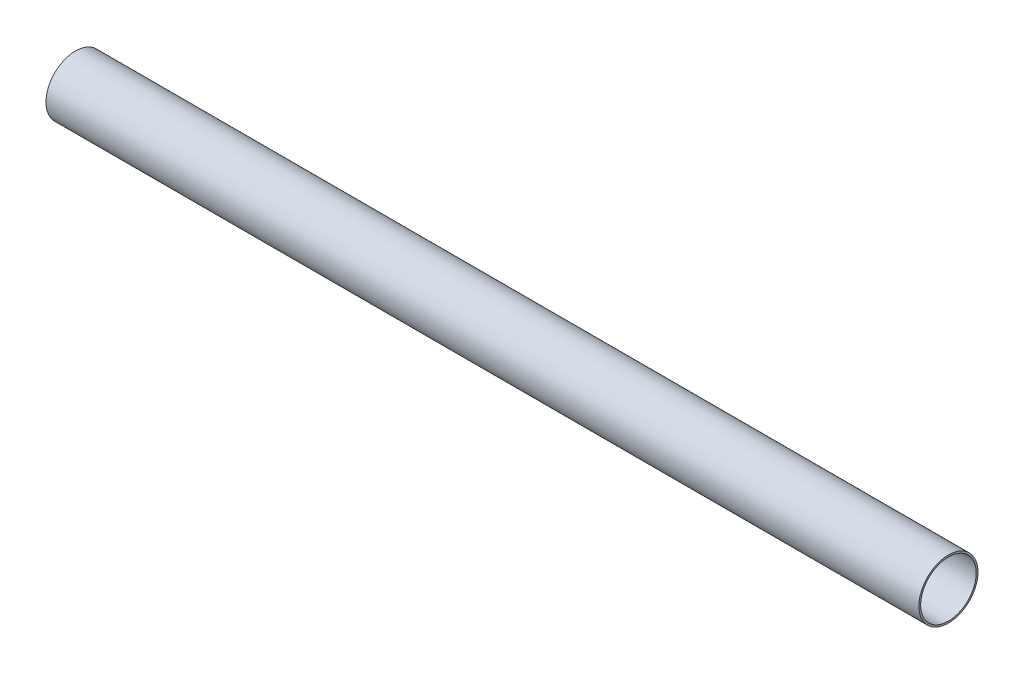
ISO-10303-21;
HEADER;
FILE_DESCRIPTION(('STEP AP214'),'2;1');
FILE_NAME('part.step','',(''),(''),'','','');
FILE_SCHEMA(('AUTOMOTIVE_DESIGN { 1 0 10303 214 1 1 1 1 }'));
ENDSEC;
DATA;
#1=APPLICATION_CONTEXT('core data for automotive mechanical design processes');
#2=APPLICATION_PROTOCOL_DEFINITION('international standard','automotive_design',2000,#1);
#3=PRODUCT_CONTEXT('',#1,'mechanical');
#4=PRODUCT('Part','Part','',(#3));
#5=PRODUCT_RELATED_PRODUCT_CATEGORY('part','',(#4));
#6=PRODUCT_DEFINITION_FORMATION('','',#4);
#7=PRODUCT_DEFINITION_CONTEXT('part definition',#1,'design');
#8=PRODUCT_DEFINITION('design','',#6,#7);
#9=PRODUCT_DEFINITION_SHAPE('','',#8);
#10=(LENGTH_UNIT() NAMED_UNIT(*) SI_UNIT(.MILLI.,.METRE.));
#11=(NAMED_UNIT(*) PLANE_ANGLE_UNIT() SI_UNIT($,.RADIAN.));
#12=(NAMED_UNIT(*) SI_UNIT($,.STERADIAN.) SOLID_ANGLE_UNIT());
#13=UNCERTAINTY_MEASURE_WITH_UNIT(LENGTH_MEASURE(1.E-05),#10,'distance_accuracy_value','');
#14=(GEOMETRIC_REPRESENTATION_CONTEXT(3) GLOBAL_UNCERTAINTY_ASSIGNED_CONTEXT((#13)) GLOBAL_UNIT_ASSIGNED_CONTEXT((#10,
#11,#12)) REPRESENTATION_CONTEXT('',''));
#15=CARTESIAN_POINT('',(0.,0.,0.));
#16=DIRECTION('',(0.,0.,1.));
#17=DIRECTION('',(1.,0.,0.));
#18=AXIS2_PLACEMENT_3D('',#15,#16,#17);
#19=CARTESIAN_POINT('',(304.8,0.,0.));
#20=DIRECTION('',(1.,0.,0.));
#21=DIRECTION('',(0.,0.,-1.));
#22=AXIS2_PLACEMENT_3D('',#19,#20,#21);
#23=PLANE('',#22);
#24=CARTESIAN_POINT('',(304.8,0.,0.));
#25=DIRECTION('',(1.,0.,0.));
#26=DIRECTION('',(0.,0.,-1.));
#27=AXIS2_PLACEMENT_3D('',#24,#25,#26);
#28=CIRCLE('',#27,20.6375);
#29=CARTESIAN_POINT('',(304.8,0.,-20.6375));
#30=VERTEX_POINT('',#29);
#31=EDGE_CURVE('E10',#30,#30,#28,.T.);
#32=ORIENTED_EDGE('',*,*,#31,.T.);
#33=EDGE_LOOP('',(#32));
#34=FACE_BOUND('',#33,.T.);
#35=CARTESIAN_POINT('',(304.8,0.,0.));
#36=DIRECTION('',(1.,0.,0.));
#37=DIRECTION('',(0.,0.,-1.));
#38=AXIS2_PLACEMENT_3D('',#35,#36,#37);
#39=CIRCLE('',#38,19.3929);
#40=CARTESIAN_POINT('',(304.8,0.,-19.3929));
#41=VERTEX_POINT('',#40);
#42=EDGE_CURVE('E41',#41,#41,#39,.T.);
#43=ORIENTED_EDGE('',*,*,#42,.F.);
#44=EDGE_LOOP('',(#43));
#45=FACE_BOUND('',#44,.T.);
#46=ADVANCED_FACE('F30',(#34,#45),#23,.T.);
#47=CARTESIAN_POINT('',(-304.8,0.,0.));
#48=DIRECTION('',(1.,0.,0.));
#49=DIRECTION('',(0.,0.,-1.));
#50=AXIS2_PLACEMENT_3D('',#47,#48,#49);
#51=PLANE('',#50);
#52=CARTESIAN_POINT('',(-304.8,0.,0.));
#53=DIRECTION('',(1.,0.,0.));
#54=DIRECTION('',(0.,0.,-1.));
#55=AXIS2_PLACEMENT_3D('',#52,#53,#54);
#56=CIRCLE('',#55,20.6375);
#57=CARTESIAN_POINT('',(-304.8,0.,-20.6375));
#58=VERTEX_POINT('',#57);
#59=EDGE_CURVE('E34',#58,#58,#56,.T.);
#60=ORIENTED_EDGE('',*,*,#59,.F.);
#61=EDGE_LOOP('',(#60));
#62=FACE_BOUND('',#61,.T.);
#63=CARTESIAN_POINT('',(-304.8,0.,0.));
#64=DIRECTION('',(1.,0.,0.));
#65=DIRECTION('',(0.,0.,-1.));
#66=AXIS2_PLACEMENT_3D('',#63,#64,#65);
#67=CIRCLE('',#66,19.3929);
#68=CARTESIAN_POINT('',(-304.8,0.,-19.3929));
#69=VERTEX_POINT('',#68);
#70=EDGE_CURVE('E43',#69,#69,#67,.T.);
#71=ORIENTED_EDGE('',*,*,#70,.T.);
#72=EDGE_LOOP('',(#71));
#73=FACE_BOUND('',#72,.T.);
#74=ADVANCED_FACE('F53',(#62,#73),#51,.F.);
#75=CARTESIAN_POINT('',(304.8,0.,0.));
#76=DIRECTION('',(-1.,0.,0.));
#77=DIRECTION('',(0.,0.,1.));
#78=AXIS2_PLACEMENT_3D('',#75,#76,#77);
#79=CYLINDRICAL_SURFACE('',#78,20.6375);
#80=ORIENTED_EDGE('',*,*,#31,.F.);
#81=EDGE_LOOP('',(#80));
#82=FACE_BOUND('',#81,.T.);
#83=ORIENTED_EDGE('',*,*,#59,.T.);
#84=EDGE_LOOP('',(#83));
#85=FACE_BOUND('',#84,.T.);
#86=ADVANCED_FACE('F32',(#82,#85),#79,.T.);
#87=CARTESIAN_POINT('',(304.8,0.,0.));
#88=DIRECTION('',(-1.,0.,0.));
#89=DIRECTION('',(0.,0.,1.));
#90=AXIS2_PLACEMENT_3D('',#87,#88,#89);
#91=CYLINDRICAL_SURFACE('',#90,19.3929);
#92=ORIENTED_EDGE('',*,*,#42,.T.);
#93=EDGE_LOOP('',(#92));
#94=FACE_BOUND('',#93,.T.);
#95=ORIENTED_EDGE('',*,*,#70,.F.);
#96=EDGE_LOOP('',(#95));
#97=FACE_BOUND('',#96,.T.);
#98=ADVANCED_FACE('F49',(#94,#97),#91,.F.);
#99=CLOSED_SHELL('',(#46,#74,#86,#98));
#100=MANIFOLD_SOLID_BREP('B2',#99);
#101=ADVANCED_BREP_SHAPE_REPRESENTATION('',(#18,#100),#14);
#102=SHAPE_DEFINITION_REPRESENTATION(#9,#101);
ENDSEC;
END-ISO-10303-21;
